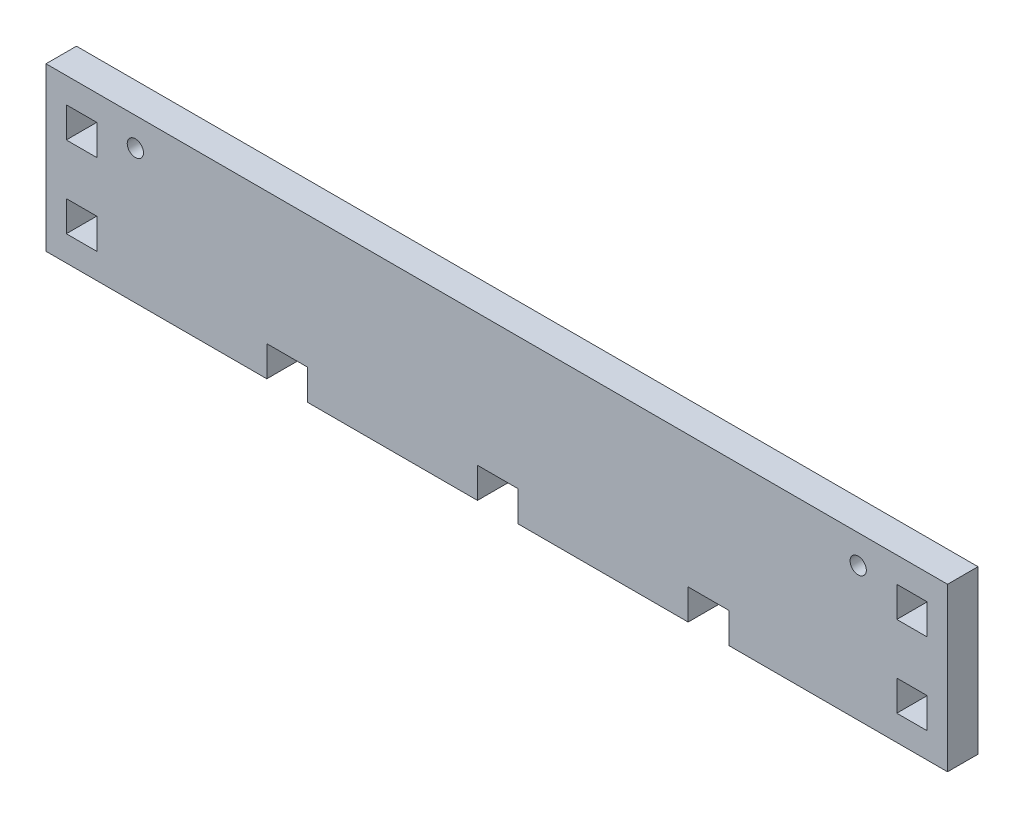
ISO-10303-21;
HEADER;
FILE_DESCRIPTION(('STEP AP214'),'2;1');
FILE_NAME('part.step','',(''),(''),'','','');
FILE_SCHEMA(('AUTOMOTIVE_DESIGN { 1 0 10303 214 1 1 1 1 }'));
ENDSEC;
DATA;
#1=APPLICATION_CONTEXT('core data for automotive mechanical design processes');
#2=APPLICATION_PROTOCOL_DEFINITION('international standard','automotive_design',2000,#1);
#3=PRODUCT_CONTEXT('',#1,'mechanical');
#4=PRODUCT('Part','Part','',(#3));
#5=PRODUCT_RELATED_PRODUCT_CATEGORY('part','',(#4));
#6=PRODUCT_DEFINITION_FORMATION('','',#4);
#7=PRODUCT_DEFINITION_CONTEXT('part definition',#1,'design');
#8=PRODUCT_DEFINITION('design','',#6,#7);
#9=PRODUCT_DEFINITION_SHAPE('','',#8);
#10=(LENGTH_UNIT() NAMED_UNIT(*) SI_UNIT(.MILLI.,.METRE.));
#11=(NAMED_UNIT(*) PLANE_ANGLE_UNIT() SI_UNIT($,.RADIAN.));
#12=(NAMED_UNIT(*) SI_UNIT($,.STERADIAN.) SOLID_ANGLE_UNIT());
#13=UNCERTAINTY_MEASURE_WITH_UNIT(LENGTH_MEASURE(1.E-05),#10,'distance_accuracy_value','');
#14=(GEOMETRIC_REPRESENTATION_CONTEXT(3) GLOBAL_UNCERTAINTY_ASSIGNED_CONTEXT((#13)) GLOBAL_UNIT_ASSIGNED_CONTEXT((#10,
#11,#12)) REPRESENTATION_CONTEXT('',''));
#15=CARTESIAN_POINT('',(0.,0.,0.));
#16=DIRECTION('',(0.,0.,1.));
#17=DIRECTION('',(1.,0.,0.));
#18=AXIS2_PLACEMENT_3D('',#15,#16,#17);
#19=CARTESIAN_POINT('',(0.,0.,15.));
#20=DIRECTION('',(0.,0.,1.));
#21=DIRECTION('',(1.,0.,0.));
#22=AXIS2_PLACEMENT_3D('',#19,#20,#21);
#23=PLANE('',#22);
#24=CARTESIAN_POINT('',(44.,66.,15.));
#25=DIRECTION('',(0.,0.,1.));
#26=DIRECTION('',(1.,0.,0.));
#27=AXIS2_PLACEMENT_3D('',#24,#25,#26);
#28=CIRCLE('',#27,4.00000000000001);
#29=CARTESIAN_POINT('',(48.,66.,15.));
#30=VERTEX_POINT('',#29);
#31=EDGE_CURVE('E284',#30,#30,#28,.T.);
#32=ORIENTED_EDGE('',*,*,#31,.F.);
#33=EDGE_LOOP('',(#32));
#34=FACE_BOUND('',#33,.T.);
#35=DIRECTION('',(1.,0.,0.));
#36=VECTOR('',#35,1.);
#37=CARTESIAN_POINT('',(0.,0.,15.));
#38=LINE('',#37,#36);
#39=CARTESIAN_POINT('',(0.,0.,15.));
#40=VERTEX_POINT('',#39);
#41=CARTESIAN_POINT('',(108.75,0.,15.));
#42=VERTEX_POINT('',#41);
#43=EDGE_CURVE('E429',#40,#42,#38,.T.);
#44=ORIENTED_EDGE('',*,*,#43,.T.);
#45=DIRECTION('',(0.,1.,0.));
#46=VECTOR('',#45,1.);
#47=CARTESIAN_POINT('',(108.75,0.,15.));
#48=LINE('',#47,#46);
#49=CARTESIAN_POINT('',(108.75,15.,15.));
#50=VERTEX_POINT('',#49);
#51=EDGE_CURVE('E433',#42,#50,#48,.T.);
#52=ORIENTED_EDGE('',*,*,#51,.T.);
#53=DIRECTION('',(1.,0.,0.));
#54=VECTOR('',#53,1.);
#55=CARTESIAN_POINT('',(108.75,15.,15.));
#56=LINE('',#55,#54);
#57=CARTESIAN_POINT('',(128.75,15.,15.));
#58=VERTEX_POINT('',#57);
#59=EDGE_CURVE('E437',#50,#58,#56,.T.);
#60=ORIENTED_EDGE('',*,*,#59,.T.);
#61=DIRECTION('',(0.,-1.,0.));
#62=VECTOR('',#61,1.);
#63=CARTESIAN_POINT('',(128.75,15.,15.));
#64=LINE('',#63,#62);
#65=CARTESIAN_POINT('',(128.75,0.,15.));
#66=VERTEX_POINT('',#65);
#67=EDGE_CURVE('E440',#58,#66,#64,.T.);
#68=ORIENTED_EDGE('',*,*,#67,.T.);
#69=DIRECTION('',(1.,0.,0.));
#70=VECTOR('',#69,1.);
#71=CARTESIAN_POINT('',(128.75,0.,15.));
#72=LINE('',#71,#70);
#73=CARTESIAN_POINT('',(212.5,0.,15.));
#74=VERTEX_POINT('',#73);
#75=EDGE_CURVE('E443',#66,#74,#72,.T.);
#76=ORIENTED_EDGE('',*,*,#75,.T.);
#77=DIRECTION('',(0.,1.,0.));
#78=VECTOR('',#77,1.);
#79=CARTESIAN_POINT('',(212.5,0.,15.));
#80=LINE('',#79,#78);
#81=CARTESIAN_POINT('',(212.5,15.,15.));
#82=VERTEX_POINT('',#81);
#83=EDGE_CURVE('E446',#74,#82,#80,.T.);
#84=ORIENTED_EDGE('',*,*,#83,.T.);
#85=DIRECTION('',(1.,0.,0.));
#86=VECTOR('',#85,1.);
#87=CARTESIAN_POINT('',(212.5,15.,15.));
#88=LINE('',#87,#86);
#89=CARTESIAN_POINT('',(232.5,15.,15.));
#90=VERTEX_POINT('',#89);
#91=EDGE_CURVE('E449',#82,#90,#88,.T.);
#92=ORIENTED_EDGE('',*,*,#91,.T.);
#93=DIRECTION('',(0.,-1.,0.));
#94=VECTOR('',#93,1.);
#95=CARTESIAN_POINT('',(232.5,15.,15.));
#96=LINE('',#95,#94);
#97=CARTESIAN_POINT('',(232.5,0.,15.));
#98=VERTEX_POINT('',#97);
#99=EDGE_CURVE('E452',#90,#98,#96,.T.);
#100=ORIENTED_EDGE('',*,*,#99,.T.);
#101=DIRECTION('',(1.,0.,0.));
#102=VECTOR('',#101,1.);
#103=CARTESIAN_POINT('',(232.5,0.,15.));
#104=LINE('',#103,#102);
#105=CARTESIAN_POINT('',(316.25,0.,15.));
#106=VERTEX_POINT('',#105);
#107=EDGE_CURVE('E455',#98,#106,#104,.T.);
#108=ORIENTED_EDGE('',*,*,#107,.T.);
#109=DIRECTION('',(0.,1.,0.));
#110=VECTOR('',#109,1.);
#111=CARTESIAN_POINT('',(316.25,0.,15.));
#112=LINE('',#111,#110);
#113=CARTESIAN_POINT('',(316.25,15.,15.));
#114=VERTEX_POINT('',#113);
#115=EDGE_CURVE('E458',#106,#114,#112,.T.);
#116=ORIENTED_EDGE('',*,*,#115,.T.);
#117=DIRECTION('',(1.,0.,0.));
#118=VECTOR('',#117,1.);
#119=CARTESIAN_POINT('',(316.25,15.,15.));
#120=LINE('',#119,#118);
#121=CARTESIAN_POINT('',(336.25,15.,15.));
#122=VERTEX_POINT('',#121);
#123=EDGE_CURVE('E461',#114,#122,#120,.T.);
#124=ORIENTED_EDGE('',*,*,#123,.T.);
#125=DIRECTION('',(0.,-1.,0.));
#126=VECTOR('',#125,1.);
#127=CARTESIAN_POINT('',(336.25,15.,15.));
#128=LINE('',#127,#126);
#129=CARTESIAN_POINT('',(336.25,0.,15.));
#130=VERTEX_POINT('',#129);
#131=EDGE_CURVE('E464',#122,#130,#128,.T.);
#132=ORIENTED_EDGE('',*,*,#131,.T.);
#133=DIRECTION('',(1.,0.,0.));
#134=VECTOR('',#133,1.);
#135=CARTESIAN_POINT('',(336.25,0.,15.));
#136=LINE('',#135,#134);
#137=CARTESIAN_POINT('',(444.,0.,15.));
#138=VERTEX_POINT('',#137);
#139=EDGE_CURVE('E467',#130,#138,#136,.T.);
#140=ORIENTED_EDGE('',*,*,#139,.T.);
#141=DIRECTION('',(0.,1.,0.));
#142=VECTOR('',#141,1.);
#143=CARTESIAN_POINT('',(444.,80.,15.));
#144=LINE('',#143,#142);
#145=CARTESIAN_POINT('',(444.,80.,15.));
#146=VERTEX_POINT('',#145);
#147=EDGE_CURVE('E470',#138,#146,#144,.T.);
#148=ORIENTED_EDGE('',*,*,#147,.T.);
#149=DIRECTION('',(-1.,0.,0.));
#150=VECTOR('',#149,1.);
#151=CARTESIAN_POINT('',(0.,80.,15.));
#152=LINE('',#151,#150);
#153=CARTESIAN_POINT('',(0.,80.,15.));
#154=VERTEX_POINT('',#153);
#155=EDGE_CURVE('E473',#146,#154,#152,.T.);
#156=ORIENTED_EDGE('',*,*,#155,.T.);
#157=DIRECTION('',(0.,-1.,0.));
#158=VECTOR('',#157,1.);
#159=CARTESIAN_POINT('',(0.,0.,15.));
#160=LINE('',#159,#158);
#161=EDGE_CURVE('E476',#154,#40,#160,.T.);
#162=ORIENTED_EDGE('',*,*,#161,.T.);
#163=EDGE_LOOP('',(#44,#52,#60,#68,#76,#84,#92,#100,#108,#116,#124,#132,#140,#148,#156,#162));
#164=FACE_BOUND('',#163,.T.);
#165=DIRECTION('',(1.,0.,0.));
#166=VECTOR('',#165,1.);
#167=CARTESIAN_POINT('',(10.,52.5,15.));
#168=LINE('',#167,#166);
#169=CARTESIAN_POINT('',(10.,52.5,15.));
#170=VERTEX_POINT('',#169);
#171=CARTESIAN_POINT('',(25.,52.5,15.));
#172=VERTEX_POINT('',#171);
#173=EDGE_CURVE('E389',#170,#172,#168,.T.);
#174=ORIENTED_EDGE('',*,*,#173,.F.);
#175=DIRECTION('',(0.,-1.,0.));
#176=VECTOR('',#175,1.);
#177=CARTESIAN_POINT('',(10.,67.5,15.));
#178=LINE('',#177,#176);
#179=CARTESIAN_POINT('',(10.,67.5,15.));
#180=VERTEX_POINT('',#179);
#181=EDGE_CURVE('E386',#180,#170,#178,.T.);
#182=ORIENTED_EDGE('',*,*,#181,.F.);
#183=DIRECTION('',(-1.,0.,0.));
#184=VECTOR('',#183,1.);
#185=CARTESIAN_POINT('',(10.,67.5,15.));
#186=LINE('',#185,#184);
#187=CARTESIAN_POINT('',(25.,67.5,15.));
#188=VERTEX_POINT('',#187);
#189=EDGE_CURVE('E397',#188,#180,#186,.T.);
#190=ORIENTED_EDGE('',*,*,#189,.F.);
#191=DIRECTION('',(0.,1.,0.));
#192=VECTOR('',#191,1.);
#193=CARTESIAN_POINT('',(25.,67.5,15.));
#194=LINE('',#193,#192);
#195=EDGE_CURVE('E393',#172,#188,#194,.T.);
#196=ORIENTED_EDGE('',*,*,#195,.F.);
#197=EDGE_LOOP('',(#174,#182,#190,#196));
#198=FACE_BOUND('',#197,.T.);
#199=DIRECTION('',(1.,0.,0.));
#200=VECTOR('',#199,1.);
#201=CARTESIAN_POINT('',(10.,12.5,15.));
#202=LINE('',#201,#200);
#203=CARTESIAN_POINT('',(10.,12.5,15.));
#204=VERTEX_POINT('',#203);
#205=CARTESIAN_POINT('',(25.,12.5,15.));
#206=VERTEX_POINT('',#205);
#207=EDGE_CURVE('E346',#204,#206,#202,.T.);
#208=ORIENTED_EDGE('',*,*,#207,.F.);
#209=DIRECTION('',(0.,-1.,0.));
#210=VECTOR('',#209,1.);
#211=CARTESIAN_POINT('',(10.,27.5,15.));
#212=LINE('',#211,#210);
#213=CARTESIAN_POINT('',(10.,27.5,15.));
#214=VERTEX_POINT('',#213);
#215=EDGE_CURVE('E343',#214,#204,#212,.T.);
#216=ORIENTED_EDGE('',*,*,#215,.F.);
#217=DIRECTION('',(-1.,0.,0.));
#218=VECTOR('',#217,1.);
#219=CARTESIAN_POINT('',(10.,27.5,15.));
#220=LINE('',#219,#218);
#221=CARTESIAN_POINT('',(25.,27.5,15.));
#222=VERTEX_POINT('',#221);
#223=EDGE_CURVE('E354',#222,#214,#220,.T.);
#224=ORIENTED_EDGE('',*,*,#223,.F.);
#225=DIRECTION('',(0.,1.,0.));
#226=VECTOR('',#225,1.);
#227=CARTESIAN_POINT('',(25.,27.5,15.));
#228=LINE('',#227,#226);
#229=EDGE_CURVE('E350',#206,#222,#228,.T.);
#230=ORIENTED_EDGE('',*,*,#229,.F.);
#231=EDGE_LOOP('',(#208,#216,#224,#230));
#232=FACE_BOUND('',#231,.T.);
#233=DIRECTION('',(0.,-1.,0.));
#234=VECTOR('',#233,1.);
#235=CARTESIAN_POINT('',(419.,27.5,15.));
#236=LINE('',#235,#234);
#237=CARTESIAN_POINT('',(419.,27.5,15.));
#238=VERTEX_POINT('',#237);
#239=CARTESIAN_POINT('',(419.,12.5,15.));
#240=VERTEX_POINT('',#239);
#241=EDGE_CURVE('E303',#238,#240,#236,.T.);
#242=ORIENTED_EDGE('',*,*,#241,.F.);
#243=DIRECTION('',(-1.,0.,0.));
#244=VECTOR('',#243,1.);
#245=CARTESIAN_POINT('',(434.,27.5,15.));
#246=LINE('',#245,#244);
#247=CARTESIAN_POINT('',(434.,27.5,15.));
#248=VERTEX_POINT('',#247);
#249=EDGE_CURVE('E300',#248,#238,#246,.T.);
#250=ORIENTED_EDGE('',*,*,#249,.F.);
#251=DIRECTION('',(0.,1.,0.));
#252=VECTOR('',#251,1.);
#253=CARTESIAN_POINT('',(434.,27.5,15.));
#254=LINE('',#253,#252);
#255=CARTESIAN_POINT('',(434.,12.5,15.));
#256=VERTEX_POINT('',#255);
#257=EDGE_CURVE('E311',#256,#248,#254,.T.);
#258=ORIENTED_EDGE('',*,*,#257,.F.);
#259=DIRECTION('',(1.,0.,0.));
#260=VECTOR('',#259,1.);
#261=CARTESIAN_POINT('',(434.,12.5,15.));
#262=LINE('',#261,#260);
#263=EDGE_CURVE('E307',#240,#256,#262,.T.);
#264=ORIENTED_EDGE('',*,*,#263,.F.);
#265=EDGE_LOOP('',(#242,#250,#258,#264));
#266=FACE_BOUND('',#265,.T.);
#267=DIRECTION('',(0.,-1.,0.));
#268=VECTOR('',#267,1.);
#269=CARTESIAN_POINT('',(419.,67.5,15.));
#270=LINE('',#269,#268);
#271=CARTESIAN_POINT('',(419.,67.5,15.));
#272=VERTEX_POINT('',#271);
#273=CARTESIAN_POINT('',(419.,52.5,15.));
#274=VERTEX_POINT('',#273);
#275=EDGE_CURVE('E258',#272,#274,#270,.T.);
#276=ORIENTED_EDGE('',*,*,#275,.F.);
#277=DIRECTION('',(-1.,0.,0.));
#278=VECTOR('',#277,1.);
#279=CARTESIAN_POINT('',(434.,67.5,15.));
#280=LINE('',#279,#278);
#281=CARTESIAN_POINT('',(434.,67.5,15.));
#282=VERTEX_POINT('',#281);
#283=EDGE_CURVE('E249',#282,#272,#280,.T.);
#284=ORIENTED_EDGE('',*,*,#283,.F.);
#285=DIRECTION('',(0.,1.,0.));
#286=VECTOR('',#285,1.);
#287=CARTESIAN_POINT('',(434.,67.5,15.));
#288=LINE('',#287,#286);
#289=CARTESIAN_POINT('',(434.,52.5,15.));
#290=VERTEX_POINT('',#289);
#291=EDGE_CURVE('E276',#290,#282,#288,.T.);
#292=ORIENTED_EDGE('',*,*,#291,.F.);
#293=DIRECTION('',(1.,0.,0.));
#294=VECTOR('',#293,1.);
#295=CARTESIAN_POINT('',(434.,52.5,15.));
#296=LINE('',#295,#294);
#297=EDGE_CURVE('E272',#274,#290,#296,.T.);
#298=ORIENTED_EDGE('',*,*,#297,.F.);
#299=EDGE_LOOP('',(#276,#284,#292,#298));
#300=FACE_BOUND('',#299,.T.);
#301=CARTESIAN_POINT('',(400.,66.,15.));
#302=DIRECTION('',(0.,0.,1.));
#303=DIRECTION('',(-1.,0.,0.));
#304=AXIS2_PLACEMENT_3D('',#301,#302,#303);
#305=CIRCLE('',#304,3.99999999999994);
#306=CARTESIAN_POINT('',(396.,66.,15.));
#307=VERTEX_POINT('',#306);
#308=EDGE_CURVE('E988',#307,#307,#305,.T.);
#309=ORIENTED_EDGE('',*,*,#308,.F.);
#310=EDGE_LOOP('',(#309));
#311=FACE_BOUND('',#310,.T.);
#312=ADVANCED_FACE('F39',(#34,#164,#198,#232,#266,#300,#311),#23,.T.);
#313=CARTESIAN_POINT('',(0.,0.,0.));
#314=DIRECTION('',(0.,0.,1.));
#315=DIRECTION('',(1.,0.,0.));
#316=AXIS2_PLACEMENT_3D('',#313,#314,#315);
#317=PLANE('',#316);
#318=DIRECTION('',(-1.,0.,0.));
#319=VECTOR('',#318,1.);
#320=CARTESIAN_POINT('',(434.,27.5,0.));
#321=LINE('',#320,#319);
#322=CARTESIAN_POINT('',(434.,27.5,0.));
#323=VERTEX_POINT('',#322);
#324=CARTESIAN_POINT('',(419.,27.5,0.));
#325=VERTEX_POINT('',#324);
#326=EDGE_CURVE('E267',#323,#325,#321,.T.);
#327=ORIENTED_EDGE('',*,*,#326,.T.);
#328=DIRECTION('',(0.,-1.,0.));
#329=VECTOR('',#328,1.);
#330=CARTESIAN_POINT('',(419.,27.5,0.));
#331=LINE('',#330,#329);
#332=CARTESIAN_POINT('',(419.,12.5,0.));
#333=VERTEX_POINT('',#332);
#334=EDGE_CURVE('E318',#325,#333,#331,.T.);
#335=ORIENTED_EDGE('',*,*,#334,.T.);
#336=DIRECTION('',(1.,0.,0.));
#337=VECTOR('',#336,1.);
#338=CARTESIAN_POINT('',(434.,12.5,0.));
#339=LINE('',#338,#337);
#340=CARTESIAN_POINT('',(434.,12.5,0.));
#341=VERTEX_POINT('',#340);
#342=EDGE_CURVE('E322',#333,#341,#339,.T.);
#343=ORIENTED_EDGE('',*,*,#342,.T.);
#344=DIRECTION('',(0.,1.,0.));
#345=VECTOR('',#344,1.);
#346=CARTESIAN_POINT('',(434.,27.5,0.));
#347=LINE('',#346,#345);
#348=EDGE_CURVE('E304',#341,#323,#347,.T.);
#349=ORIENTED_EDGE('',*,*,#348,.T.);
#350=EDGE_LOOP('',(#327,#335,#343,#349));
#351=FACE_BOUND('',#350,.T.);
#352=DIRECTION('',(0.,-1.,0.));
#353=VECTOR('',#352,1.);
#354=CARTESIAN_POINT('',(10.,67.5,0.));
#355=LINE('',#354,#353);
#356=CARTESIAN_POINT('',(10.,67.5,0.));
#357=VERTEX_POINT('',#356);
#358=CARTESIAN_POINT('',(10.,52.5,0.));
#359=VERTEX_POINT('',#358);
#360=EDGE_CURVE('E385',#357,#359,#355,.T.);
#361=ORIENTED_EDGE('',*,*,#360,.T.);
#362=DIRECTION('',(1.,0.,0.));
#363=VECTOR('',#362,1.);
#364=CARTESIAN_POINT('',(10.,52.5,0.));
#365=LINE('',#364,#363);
#366=CARTESIAN_POINT('',(25.,52.5,0.));
#367=VERTEX_POINT('',#366);
#368=EDGE_CURVE('E404',#359,#367,#365,.T.);
#369=ORIENTED_EDGE('',*,*,#368,.T.);
#370=DIRECTION('',(0.,1.,0.));
#371=VECTOR('',#370,1.);
#372=CARTESIAN_POINT('',(25.,67.5,0.));
#373=LINE('',#372,#371);
#374=CARTESIAN_POINT('',(25.,67.5,0.));
#375=VERTEX_POINT('',#374);
#376=EDGE_CURVE('E408',#367,#375,#373,.T.);
#377=ORIENTED_EDGE('',*,*,#376,.T.);
#378=DIRECTION('',(-1.,0.,0.));
#379=VECTOR('',#378,1.);
#380=CARTESIAN_POINT('',(10.,67.5,0.));
#381=LINE('',#380,#379);
#382=EDGE_CURVE('E390',#375,#357,#381,.T.);
#383=ORIENTED_EDGE('',*,*,#382,.T.);
#384=EDGE_LOOP('',(#361,#369,#377,#383));
#385=FACE_BOUND('',#384,.T.);
#386=DIRECTION('',(1.,0.,0.));
#387=VECTOR('',#386,1.);
#388=CARTESIAN_POINT('',(0.,0.,0.));
#389=LINE('',#388,#387);
#390=CARTESIAN_POINT('',(0.,0.,0.));
#391=VERTEX_POINT('',#390);
#392=CARTESIAN_POINT('',(108.75,0.,0.));
#393=VERTEX_POINT('',#392);
#394=EDGE_CURVE('E428',#391,#393,#389,.T.);
#395=ORIENTED_EDGE('',*,*,#394,.F.);
#396=DIRECTION('',(0.,-1.,0.));
#397=VECTOR('',#396,1.);
#398=CARTESIAN_POINT('',(0.,0.,0.));
#399=LINE('',#398,#397);
#400=CARTESIAN_POINT('',(0.,80.,0.));
#401=VERTEX_POINT('',#400);
#402=EDGE_CURVE('E434',#401,#391,#399,.T.);
#403=ORIENTED_EDGE('',*,*,#402,.F.);
#404=DIRECTION('',(-1.,0.,0.));
#405=VECTOR('',#404,1.);
#406=CARTESIAN_POINT('',(0.,80.,0.));
#407=LINE('',#406,#405);
#408=CARTESIAN_POINT('',(444.,80.,0.));
#409=VERTEX_POINT('',#408);
#410=EDGE_CURVE('E522',#409,#401,#407,.T.);
#411=ORIENTED_EDGE('',*,*,#410,.F.);
#412=DIRECTION('',(0.,1.,0.));
#413=VECTOR('',#412,1.);
#414=CARTESIAN_POINT('',(444.,80.,0.));
#415=LINE('',#414,#413);
#416=CARTESIAN_POINT('',(444.,0.,0.));
#417=VERTEX_POINT('',#416);
#418=EDGE_CURVE('E519',#417,#409,#415,.T.);
#419=ORIENTED_EDGE('',*,*,#418,.F.);
#420=DIRECTION('',(1.,0.,0.));
#421=VECTOR('',#420,1.);
#422=CARTESIAN_POINT('',(336.25,0.,0.));
#423=LINE('',#422,#421);
#424=CARTESIAN_POINT('',(336.25,0.,0.));
#425=VERTEX_POINT('',#424);
#426=EDGE_CURVE('E516',#425,#417,#423,.T.);
#427=ORIENTED_EDGE('',*,*,#426,.F.);
#428=DIRECTION('',(0.,-1.,0.));
#429=VECTOR('',#428,1.);
#430=CARTESIAN_POINT('',(336.25,15.,0.));
#431=LINE('',#430,#429);
#432=CARTESIAN_POINT('',(336.25,15.,0.));
#433=VERTEX_POINT('',#432);
#434=EDGE_CURVE('E513',#433,#425,#431,.T.);
#435=ORIENTED_EDGE('',*,*,#434,.F.);
#436=DIRECTION('',(1.,0.,0.));
#437=VECTOR('',#436,1.);
#438=CARTESIAN_POINT('',(316.25,15.,0.));
#439=LINE('',#438,#437);
#440=CARTESIAN_POINT('',(316.25,15.,0.));
#441=VERTEX_POINT('',#440);
#442=EDGE_CURVE('E510',#441,#433,#439,.T.);
#443=ORIENTED_EDGE('',*,*,#442,.F.);
#444=DIRECTION('',(0.,1.,0.));
#445=VECTOR('',#444,1.);
#446=CARTESIAN_POINT('',(316.25,0.,0.));
#447=LINE('',#446,#445);
#448=CARTESIAN_POINT('',(316.25,0.,0.));
#449=VERTEX_POINT('',#448);
#450=EDGE_CURVE('E507',#449,#441,#447,.T.);
#451=ORIENTED_EDGE('',*,*,#450,.F.);
#452=DIRECTION('',(1.,0.,0.));
#453=VECTOR('',#452,1.);
#454=CARTESIAN_POINT('',(232.5,0.,0.));
#455=LINE('',#454,#453);
#456=CARTESIAN_POINT('',(232.5,0.,0.));
#457=VERTEX_POINT('',#456);
#458=EDGE_CURVE('E504',#457,#449,#455,.T.);
#459=ORIENTED_EDGE('',*,*,#458,.F.);
#460=DIRECTION('',(0.,-1.,0.));
#461=VECTOR('',#460,1.);
#462=CARTESIAN_POINT('',(232.5,15.,0.));
#463=LINE('',#462,#461);
#464=CARTESIAN_POINT('',(232.5,15.,0.));
#465=VERTEX_POINT('',#464);
#466=EDGE_CURVE('E501',#465,#457,#463,.T.);
#467=ORIENTED_EDGE('',*,*,#466,.F.);
#468=DIRECTION('',(1.,0.,0.));
#469=VECTOR('',#468,1.);
#470=CARTESIAN_POINT('',(212.5,15.,0.));
#471=LINE('',#470,#469);
#472=CARTESIAN_POINT('',(212.5,15.,0.));
#473=VERTEX_POINT('',#472);
#474=EDGE_CURVE('E498',#473,#465,#471,.T.);
#475=ORIENTED_EDGE('',*,*,#474,.F.);
#476=DIRECTION('',(0.,1.,0.));
#477=VECTOR('',#476,1.);
#478=CARTESIAN_POINT('',(212.5,0.,0.));
#479=LINE('',#478,#477);
#480=CARTESIAN_POINT('',(212.5,0.,0.));
#481=VERTEX_POINT('',#480);
#482=EDGE_CURVE('E495',#481,#473,#479,.T.);
#483=ORIENTED_EDGE('',*,*,#482,.F.);
#484=DIRECTION('',(1.,0.,0.));
#485=VECTOR('',#484,1.);
#486=CARTESIAN_POINT('',(128.75,0.,0.));
#487=LINE('',#486,#485);
#488=CARTESIAN_POINT('',(128.75,0.,0.));
#489=VERTEX_POINT('',#488);
#490=EDGE_CURVE('E492',#489,#481,#487,.T.);
#491=ORIENTED_EDGE('',*,*,#490,.F.);
#492=DIRECTION('',(0.,-1.,0.));
#493=VECTOR('',#492,1.);
#494=CARTESIAN_POINT('',(128.75,15.,0.));
#495=LINE('',#494,#493);
#496=CARTESIAN_POINT('',(128.75,15.,0.));
#497=VERTEX_POINT('',#496);
#498=EDGE_CURVE('E489',#497,#489,#495,.T.);
#499=ORIENTED_EDGE('',*,*,#498,.F.);
#500=DIRECTION('',(1.,0.,0.));
#501=VECTOR('',#500,1.);
#502=CARTESIAN_POINT('',(108.75,15.,0.));
#503=LINE('',#502,#501);
#504=CARTESIAN_POINT('',(108.75,15.,0.));
#505=VERTEX_POINT('',#504);
#506=EDGE_CURVE('E486',#505,#497,#503,.T.);
#507=ORIENTED_EDGE('',*,*,#506,.F.);
#508=DIRECTION('',(0.,1.,0.));
#509=VECTOR('',#508,1.);
#510=CARTESIAN_POINT('',(108.75,0.,0.));
#511=LINE('',#510,#509);
#512=EDGE_CURVE('E483',#393,#505,#511,.T.);
#513=ORIENTED_EDGE('',*,*,#512,.F.);
#514=EDGE_LOOP('',(#395,#403,#411,#419,#427,#435,#443,#451,#459,#467,#475,#483,#491,#499,#507,#513));
#515=FACE_BOUND('',#514,.T.);
#516=DIRECTION('',(0.,-1.,0.));
#517=VECTOR('',#516,1.);
#518=CARTESIAN_POINT('',(10.,27.5,0.));
#519=LINE('',#518,#517);
#520=CARTESIAN_POINT('',(10.,27.5,0.));
#521=VERTEX_POINT('',#520);
#522=CARTESIAN_POINT('',(10.,12.5,0.));
#523=VERTEX_POINT('',#522);
#524=EDGE_CURVE('E342',#521,#523,#519,.T.);
#525=ORIENTED_EDGE('',*,*,#524,.T.);
#526=DIRECTION('',(1.,0.,0.));
#527=VECTOR('',#526,1.);
#528=CARTESIAN_POINT('',(10.,12.5,0.));
#529=LINE('',#528,#527);
#530=CARTESIAN_POINT('',(25.,12.5,0.));
#531=VERTEX_POINT('',#530);
#532=EDGE_CURVE('E361',#523,#531,#529,.T.);
#533=ORIENTED_EDGE('',*,*,#532,.T.);
#534=DIRECTION('',(0.,1.,0.));
#535=VECTOR('',#534,1.);
#536=CARTESIAN_POINT('',(25.,27.5,0.));
#537=LINE('',#536,#535);
#538=CARTESIAN_POINT('',(25.,27.5,0.));
#539=VERTEX_POINT('',#538);
#540=EDGE_CURVE('E365',#531,#539,#537,.T.);
#541=ORIENTED_EDGE('',*,*,#540,.T.);
#542=DIRECTION('',(-1.,0.,0.));
#543=VECTOR('',#542,1.);
#544=CARTESIAN_POINT('',(10.,27.5,0.));
#545=LINE('',#544,#543);
#546=EDGE_CURVE('E347',#539,#521,#545,.T.);
#547=ORIENTED_EDGE('',*,*,#546,.T.);
#548=EDGE_LOOP('',(#525,#533,#541,#547));
#549=FACE_BOUND('',#548,.T.);
#550=DIRECTION('',(-1.,0.,0.));
#551=VECTOR('',#550,1.);
#552=CARTESIAN_POINT('',(434.,67.5,0.));
#553=LINE('',#552,#551);
#554=CARTESIAN_POINT('',(434.,67.5,0.));
#555=VERTEX_POINT('',#554);
#556=CARTESIAN_POINT('',(419.,67.5,0.));
#557=VERTEX_POINT('',#556);
#558=EDGE_CURVE('E63',#555,#557,#553,.T.);
#559=ORIENTED_EDGE('',*,*,#558,.T.);
#560=DIRECTION('',(0.,-1.,0.));
#561=VECTOR('',#560,1.);
#562=CARTESIAN_POINT('',(419.,67.5,0.));
#563=LINE('',#562,#561);
#564=CARTESIAN_POINT('',(419.,52.5,0.));
#565=VERTEX_POINT('',#564);
#566=EDGE_CURVE('E265',#557,#565,#563,.T.);
#567=ORIENTED_EDGE('',*,*,#566,.T.);
#568=DIRECTION('',(1.,0.,0.));
#569=VECTOR('',#568,1.);
#570=CARTESIAN_POINT('',(434.,52.5,0.));
#571=LINE('',#570,#569);
#572=CARTESIAN_POINT('',(434.,52.5,0.));
#573=VERTEX_POINT('',#572);
#574=EDGE_CURVE('E287',#565,#573,#571,.T.);
#575=ORIENTED_EDGE('',*,*,#574,.T.);
#576=DIRECTION('',(0.,1.,0.));
#577=VECTOR('',#576,1.);
#578=CARTESIAN_POINT('',(434.,67.5,0.));
#579=LINE('',#578,#577);
#580=EDGE_CURVE('E259',#573,#555,#579,.T.);
#581=ORIENTED_EDGE('',*,*,#580,.T.);
#582=EDGE_LOOP('',(#559,#567,#575,#581));
#583=FACE_BOUND('',#582,.T.);
#584=CARTESIAN_POINT('',(44.,66.,0.));
#585=DIRECTION('',(0.,0.,1.));
#586=DIRECTION('',(1.,0.,0.));
#587=AXIS2_PLACEMENT_3D('',#584,#585,#586);
#588=CIRCLE('',#587,4.00000000000001);
#589=CARTESIAN_POINT('',(48.,66.,0.));
#590=VERTEX_POINT('',#589);
#591=EDGE_CURVE('E996',#590,#590,#588,.T.);
#592=ORIENTED_EDGE('',*,*,#591,.T.);
#593=EDGE_LOOP('',(#592));
#594=FACE_BOUND('',#593,.T.);
#595=CARTESIAN_POINT('',(400.,66.,0.));
#596=DIRECTION('',(0.,0.,1.));
#597=DIRECTION('',(-1.,0.,0.));
#598=AXIS2_PLACEMENT_3D('',#595,#596,#597);
#599=CIRCLE('',#598,3.99999999999994);
#600=CARTESIAN_POINT('',(396.,66.,0.));
#601=VERTEX_POINT('',#600);
#602=EDGE_CURVE('E991',#601,#601,#599,.T.);
#603=ORIENTED_EDGE('',*,*,#602,.T.);
#604=EDGE_LOOP('',(#603));
#605=FACE_BOUND('',#604,.T.);
#606=ADVANCED_FACE('F593',(#351,#385,#515,#549,#583,#594,#605),#317,.F.);
#607=CARTESIAN_POINT('',(0.,0.,15.));
#608=DIRECTION('',(0.,1.,0.));
#609=DIRECTION('',(0.,0.,1.));
#610=AXIS2_PLACEMENT_3D('',#607,#608,#609);
#611=PLANE('',#610);
#612=ORIENTED_EDGE('',*,*,#394,.T.);
#613=DIRECTION('',(0.,0.,-1.));
#614=VECTOR('',#613,1.);
#615=CARTESIAN_POINT('',(108.75,0.,15.));
#616=LINE('',#615,#614);
#617=EDGE_CURVE('E11',#42,#393,#616,.T.);
#618=ORIENTED_EDGE('',*,*,#617,.F.);
#619=ORIENTED_EDGE('',*,*,#43,.F.);
#620=DIRECTION('',(0.,0.,-1.));
#621=VECTOR('',#620,1.);
#622=CARTESIAN_POINT('',(0.,0.,15.));
#623=LINE('',#622,#621);
#624=EDGE_CURVE('E479',#40,#391,#623,.T.);
#625=ORIENTED_EDGE('',*,*,#624,.T.);
#626=EDGE_LOOP('',(#612,#618,#619,#625));
#627=FACE_BOUND('',#626,.T.);
#628=ADVANCED_FACE('F41',(#627),#611,.F.);
#629=CARTESIAN_POINT('',(108.75,0.,15.));
#630=DIRECTION('',(-1.,0.,0.));
#631=DIRECTION('',(0.,0.,1.));
#632=AXIS2_PLACEMENT_3D('',#629,#630,#631);
#633=PLANE('',#632);
#634=ORIENTED_EDGE('',*,*,#512,.T.);
#635=DIRECTION('',(0.,0.,-1.));
#636=VECTOR('',#635,1.);
#637=CARTESIAN_POINT('',(108.75,15.,15.));
#638=LINE('',#637,#636);
#639=EDGE_CURVE('E48',#50,#505,#638,.T.);
#640=ORIENTED_EDGE('',*,*,#639,.F.);
#641=ORIENTED_EDGE('',*,*,#51,.F.);
#642=ORIENTED_EDGE('',*,*,#617,.T.);
#643=EDGE_LOOP('',(#634,#640,#641,#642));
#644=FACE_BOUND('',#643,.T.);
#645=ADVANCED_FACE('F611',(#644),#633,.F.);
#646=CARTESIAN_POINT('',(108.75,15.,15.));
#647=DIRECTION('',(0.,1.,0.));
#648=DIRECTION('',(0.,0.,1.));
#649=AXIS2_PLACEMENT_3D('',#646,#647,#648);
#650=PLANE('',#649);
#651=ORIENTED_EDGE('',*,*,#506,.T.);
#652=DIRECTION('',(0.,0.,-1.));
#653=VECTOR('',#652,1.);
#654=CARTESIAN_POINT('',(128.75,15.,15.));
#655=LINE('',#654,#653);
#656=EDGE_CURVE('E578',#58,#497,#655,.T.);
#657=ORIENTED_EDGE('',*,*,#656,.F.);
#658=ORIENTED_EDGE('',*,*,#59,.F.);
#659=ORIENTED_EDGE('',*,*,#639,.T.);
#660=EDGE_LOOP('',(#651,#657,#658,#659));
#661=FACE_BOUND('',#660,.T.);
#662=ADVANCED_FACE('F587',(#661),#650,.F.);
#663=CARTESIAN_POINT('',(128.75,15.,15.));
#664=DIRECTION('',(1.,0.,0.));
#665=DIRECTION('',(0.,0.,-1.));
#666=AXIS2_PLACEMENT_3D('',#663,#664,#665);
#667=PLANE('',#666);
#668=ORIENTED_EDGE('',*,*,#498,.T.);
#669=DIRECTION('',(0.,0.,-1.));
#670=VECTOR('',#669,1.);
#671=CARTESIAN_POINT('',(128.75,0.,15.));
#672=LINE('',#671,#670);
#673=EDGE_CURVE('E574',#66,#489,#672,.T.);
#674=ORIENTED_EDGE('',*,*,#673,.F.);
#675=ORIENTED_EDGE('',*,*,#67,.F.);
#676=ORIENTED_EDGE('',*,*,#656,.T.);
#677=EDGE_LOOP('',(#668,#674,#675,#676));
#678=FACE_BOUND('',#677,.T.);
#679=ADVANCED_FACE('F599',(#678),#667,.F.);
#680=CARTESIAN_POINT('',(128.75,0.,15.));
#681=DIRECTION('',(0.,1.,0.));
#682=DIRECTION('',(0.,0.,1.));
#683=AXIS2_PLACEMENT_3D('',#680,#681,#682);
#684=PLANE('',#683);
#685=ORIENTED_EDGE('',*,*,#490,.T.);
#686=DIRECTION('',(0.,0.,-1.));
#687=VECTOR('',#686,1.);
#688=CARTESIAN_POINT('',(212.5,0.,15.));
#689=LINE('',#688,#687);
#690=EDGE_CURVE('E570',#74,#481,#689,.T.);
#691=ORIENTED_EDGE('',*,*,#690,.F.);
#692=ORIENTED_EDGE('',*,*,#75,.F.);
#693=ORIENTED_EDGE('',*,*,#673,.T.);
#694=EDGE_LOOP('',(#685,#691,#692,#693));
#695=FACE_BOUND('',#694,.T.);
#696=ADVANCED_FACE('F603',(#695),#684,.F.);
#697=CARTESIAN_POINT('',(212.5,0.,15.));
#698=DIRECTION('',(-1.,0.,0.));
#699=DIRECTION('',(0.,0.,1.));
#700=AXIS2_PLACEMENT_3D('',#697,#698,#699);
#701=PLANE('',#700);
#702=ORIENTED_EDGE('',*,*,#482,.T.);
#703=DIRECTION('',(0.,0.,-1.));
#704=VECTOR('',#703,1.);
#705=CARTESIAN_POINT('',(212.5,15.,15.));
#706=LINE('',#705,#704);
#707=EDGE_CURVE('E566',#82,#473,#706,.T.);
#708=ORIENTED_EDGE('',*,*,#707,.F.);
#709=ORIENTED_EDGE('',*,*,#83,.F.);
#710=ORIENTED_EDGE('',*,*,#690,.T.);
#711=EDGE_LOOP('',(#702,#708,#709,#710));
#712=FACE_BOUND('',#711,.T.);
#713=ADVANCED_FACE('F664',(#712),#701,.F.);
#714=CARTESIAN_POINT('',(212.5,15.,15.));
#715=DIRECTION('',(0.,1.,0.));
#716=DIRECTION('',(0.,0.,1.));
#717=AXIS2_PLACEMENT_3D('',#714,#715,#716);
#718=PLANE('',#717);
#719=ORIENTED_EDGE('',*,*,#474,.T.);
#720=DIRECTION('',(0.,0.,-1.));
#721=VECTOR('',#720,1.);
#722=CARTESIAN_POINT('',(232.5,15.,15.));
#723=LINE('',#722,#721);
#724=EDGE_CURVE('E562',#90,#465,#723,.T.);
#725=ORIENTED_EDGE('',*,*,#724,.F.);
#726=ORIENTED_EDGE('',*,*,#91,.F.);
#727=ORIENTED_EDGE('',*,*,#707,.T.);
#728=EDGE_LOOP('',(#719,#725,#726,#727));
#729=FACE_BOUND('',#728,.T.);
#730=ADVANCED_FACE('F661',(#729),#718,.F.);
#731=CARTESIAN_POINT('',(232.5,15.,15.));
#732=DIRECTION('',(1.,0.,0.));
#733=DIRECTION('',(0.,0.,-1.));
#734=AXIS2_PLACEMENT_3D('',#731,#732,#733);
#735=PLANE('',#734);
#736=ORIENTED_EDGE('',*,*,#466,.T.);
#737=DIRECTION('',(0.,0.,-1.));
#738=VECTOR('',#737,1.);
#739=CARTESIAN_POINT('',(232.5,0.,15.));
#740=LINE('',#739,#738);
#741=EDGE_CURVE('E558',#98,#457,#740,.T.);
#742=ORIENTED_EDGE('',*,*,#741,.F.);
#743=ORIENTED_EDGE('',*,*,#99,.F.);
#744=ORIENTED_EDGE('',*,*,#724,.T.);
#745=EDGE_LOOP('',(#736,#742,#743,#744));
#746=FACE_BOUND('',#745,.T.);
#747=ADVANCED_FACE('F657',(#746),#735,.F.);
#748=CARTESIAN_POINT('',(232.5,0.,15.));
#749=DIRECTION('',(0.,1.,0.));
#750=DIRECTION('',(0.,0.,1.));
#751=AXIS2_PLACEMENT_3D('',#748,#749,#750);
#752=PLANE('',#751);
#753=ORIENTED_EDGE('',*,*,#458,.T.);
#754=DIRECTION('',(0.,0.,-1.));
#755=VECTOR('',#754,1.);
#756=CARTESIAN_POINT('',(316.25,0.,15.));
#757=LINE('',#756,#755);
#758=EDGE_CURVE('E554',#106,#449,#757,.T.);
#759=ORIENTED_EDGE('',*,*,#758,.F.);
#760=ORIENTED_EDGE('',*,*,#107,.F.);
#761=ORIENTED_EDGE('',*,*,#741,.T.);
#762=EDGE_LOOP('',(#753,#759,#760,#761));
#763=FACE_BOUND('',#762,.T.);
#764=ADVANCED_FACE('F653',(#763),#752,.F.);
#765=CARTESIAN_POINT('',(316.25,0.,15.));
#766=DIRECTION('',(-1.,0.,0.));
#767=DIRECTION('',(0.,0.,1.));
#768=AXIS2_PLACEMENT_3D('',#765,#766,#767);
#769=PLANE('',#768);
#770=ORIENTED_EDGE('',*,*,#450,.T.);
#771=DIRECTION('',(0.,0.,-1.));
#772=VECTOR('',#771,1.);
#773=CARTESIAN_POINT('',(316.25,15.,15.));
#774=LINE('',#773,#772);
#775=EDGE_CURVE('E550',#114,#441,#774,.T.);
#776=ORIENTED_EDGE('',*,*,#775,.F.);
#777=ORIENTED_EDGE('',*,*,#115,.F.);
#778=ORIENTED_EDGE('',*,*,#758,.T.);
#779=EDGE_LOOP('',(#770,#776,#777,#778));
#780=FACE_BOUND('',#779,.T.);
#781=ADVANCED_FACE('F648',(#780),#769,.F.);
#782=CARTESIAN_POINT('',(316.25,15.,15.));
#783=DIRECTION('',(0.,1.,0.));
#784=DIRECTION('',(0.,0.,1.));
#785=AXIS2_PLACEMENT_3D('',#782,#783,#784);
#786=PLANE('',#785);
#787=ORIENTED_EDGE('',*,*,#442,.T.);
#788=DIRECTION('',(0.,0.,-1.));
#789=VECTOR('',#788,1.);
#790=CARTESIAN_POINT('',(336.25,15.,15.));
#791=LINE('',#790,#789);
#792=EDGE_CURVE('E546',#122,#433,#791,.T.);
#793=ORIENTED_EDGE('',*,*,#792,.F.);
#794=ORIENTED_EDGE('',*,*,#123,.F.);
#795=ORIENTED_EDGE('',*,*,#775,.T.);
#796=EDGE_LOOP('',(#787,#793,#794,#795));
#797=FACE_BOUND('',#796,.T.);
#798=ADVANCED_FACE('F642',(#797),#786,.F.);
#799=CARTESIAN_POINT('',(336.25,15.,15.));
#800=DIRECTION('',(1.,0.,0.));
#801=DIRECTION('',(0.,0.,-1.));
#802=AXIS2_PLACEMENT_3D('',#799,#800,#801);
#803=PLANE('',#802);
#804=ORIENTED_EDGE('',*,*,#434,.T.);
#805=DIRECTION('',(0.,0.,-1.));
#806=VECTOR('',#805,1.);
#807=CARTESIAN_POINT('',(336.25,0.,15.));
#808=LINE('',#807,#806);
#809=EDGE_CURVE('E542',#130,#425,#808,.T.);
#810=ORIENTED_EDGE('',*,*,#809,.F.);
#811=ORIENTED_EDGE('',*,*,#131,.F.);
#812=ORIENTED_EDGE('',*,*,#792,.T.);
#813=EDGE_LOOP('',(#804,#810,#811,#812));
#814=FACE_BOUND('',#813,.T.);
#815=ADVANCED_FACE('F638',(#814),#803,.F.);
#816=CARTESIAN_POINT('',(336.25,0.,15.));
#817=DIRECTION('',(0.,1.,0.));
#818=DIRECTION('',(0.,0.,1.));
#819=AXIS2_PLACEMENT_3D('',#816,#817,#818);
#820=PLANE('',#819);
#821=ORIENTED_EDGE('',*,*,#426,.T.);
#822=DIRECTION('',(0.,0.,-1.));
#823=VECTOR('',#822,1.);
#824=CARTESIAN_POINT('',(444.,0.,15.));
#825=LINE('',#824,#823);
#826=EDGE_CURVE('E538',#138,#417,#825,.T.);
#827=ORIENTED_EDGE('',*,*,#826,.F.);
#828=ORIENTED_EDGE('',*,*,#139,.F.);
#829=ORIENTED_EDGE('',*,*,#809,.T.);
#830=EDGE_LOOP('',(#821,#827,#828,#829));
#831=FACE_BOUND('',#830,.T.);
#832=ADVANCED_FACE('F633',(#831),#820,.F.);
#833=CARTESIAN_POINT('',(444.,80.,15.));
#834=DIRECTION('',(-1.,0.,0.));
#835=DIRECTION('',(0.,0.,1.));
#836=AXIS2_PLACEMENT_3D('',#833,#834,#835);
#837=PLANE('',#836);
#838=ORIENTED_EDGE('',*,*,#418,.T.);
#839=DIRECTION('',(0.,0.,-1.));
#840=VECTOR('',#839,1.);
#841=CARTESIAN_POINT('',(444.,80.,15.));
#842=LINE('',#841,#840);
#843=EDGE_CURVE('E534',#146,#409,#842,.T.);
#844=ORIENTED_EDGE('',*,*,#843,.F.);
#845=ORIENTED_EDGE('',*,*,#147,.F.);
#846=ORIENTED_EDGE('',*,*,#826,.T.);
#847=EDGE_LOOP('',(#838,#844,#845,#846));
#848=FACE_BOUND('',#847,.T.);
#849=ADVANCED_FACE('F627',(#848),#837,.F.);
#850=CARTESIAN_POINT('',(0.,80.,15.));
#851=DIRECTION('',(0.,-1.,0.));
#852=DIRECTION('',(0.,0.,-1.));
#853=AXIS2_PLACEMENT_3D('',#850,#851,#852);
#854=PLANE('',#853);
#855=ORIENTED_EDGE('',*,*,#410,.T.);
#856=DIRECTION('',(0.,0.,-1.));
#857=VECTOR('',#856,1.);
#858=CARTESIAN_POINT('',(0.,80.,15.));
#859=LINE('',#858,#857);
#860=EDGE_CURVE('E530',#154,#401,#859,.T.);
#861=ORIENTED_EDGE('',*,*,#860,.F.);
#862=ORIENTED_EDGE('',*,*,#155,.F.);
#863=ORIENTED_EDGE('',*,*,#843,.T.);
#864=EDGE_LOOP('',(#855,#861,#862,#863));
#865=FACE_BOUND('',#864,.T.);
#866=ADVANCED_FACE('F623',(#865),#854,.F.);
#867=CARTESIAN_POINT('',(0.,0.,15.));
#868=DIRECTION('',(1.,0.,0.));
#869=DIRECTION('',(0.,0.,-1.));
#870=AXIS2_PLACEMENT_3D('',#867,#868,#869);
#871=PLANE('',#870);
#872=ORIENTED_EDGE('',*,*,#402,.T.);
#873=ORIENTED_EDGE('',*,*,#624,.F.);
#874=ORIENTED_EDGE('',*,*,#161,.F.);
#875=ORIENTED_EDGE('',*,*,#860,.T.);
#876=EDGE_LOOP('',(#872,#873,#874,#875));
#877=FACE_BOUND('',#876,.T.);
#878=ADVANCED_FACE('F618',(#877),#871,.F.);
#879=CARTESIAN_POINT('',(10.,67.5,15.));
#880=DIRECTION('',(1.,0.,0.));
#881=DIRECTION('',(0.,1.,0.));
#882=AXIS2_PLACEMENT_3D('',#879,#880,#881);
#883=PLANE('',#882);
#884=ORIENTED_EDGE('',*,*,#360,.F.);
#885=DIRECTION('',(0.,0.,-1.));
#886=VECTOR('',#885,1.);
#887=CARTESIAN_POINT('',(10.,67.5,15.));
#888=LINE('',#887,#886);
#889=EDGE_CURVE('E400',#180,#357,#888,.T.);
#890=ORIENTED_EDGE('',*,*,#889,.F.);
#891=ORIENTED_EDGE('',*,*,#181,.T.);
#892=DIRECTION('',(0.,0.,-1.));
#893=VECTOR('',#892,1.);
#894=CARTESIAN_POINT('',(10.,52.5,15.));
#895=LINE('',#894,#893);
#896=EDGE_CURVE('E424',#170,#359,#895,.T.);
#897=ORIENTED_EDGE('',*,*,#896,.T.);
#898=EDGE_LOOP('',(#884,#890,#891,#897));
#899=FACE_BOUND('',#898,.T.);
#900=ADVANCED_FACE('F683',(#899),#883,.T.);
#901=CARTESIAN_POINT('',(10.,52.5,15.));
#902=DIRECTION('',(0.,1.,0.));
#903=DIRECTION('',(0.,0.,1.));
#904=AXIS2_PLACEMENT_3D('',#901,#902,#903);
#905=PLANE('',#904);
#906=ORIENTED_EDGE('',*,*,#368,.F.);
#907=ORIENTED_EDGE('',*,*,#896,.F.);
#908=ORIENTED_EDGE('',*,*,#173,.T.);
#909=DIRECTION('',(0.,0.,-1.));
#910=VECTOR('',#909,1.);
#911=CARTESIAN_POINT('',(25.,52.5,15.));
#912=LINE('',#911,#910);
#913=EDGE_CURVE('E421',#172,#367,#912,.T.);
#914=ORIENTED_EDGE('',*,*,#913,.T.);
#915=EDGE_LOOP('',(#906,#907,#908,#914));
#916=FACE_BOUND('',#915,.T.);
#917=ADVANCED_FACE('F745',(#916),#905,.T.);
#918=CARTESIAN_POINT('',(25.,67.5,15.));
#919=DIRECTION('',(-1.,0.,0.));
#920=DIRECTION('',(0.,0.,1.));
#921=AXIS2_PLACEMENT_3D('',#918,#919,#920);
#922=PLANE('',#921);
#923=ORIENTED_EDGE('',*,*,#376,.F.);
#924=ORIENTED_EDGE('',*,*,#913,.F.);
#925=ORIENTED_EDGE('',*,*,#195,.T.);
#926=DIRECTION('',(0.,0.,-1.));
#927=VECTOR('',#926,1.);
#928=CARTESIAN_POINT('',(25.,67.5,15.));
#929=LINE('',#928,#927);
#930=EDGE_CURVE('E418',#188,#375,#929,.T.);
#931=ORIENTED_EDGE('',*,*,#930,.T.);
#932=EDGE_LOOP('',(#923,#924,#925,#931));
#933=FACE_BOUND('',#932,.T.);
#934=ADVANCED_FACE('F752',(#933),#922,.T.);
#935=CARTESIAN_POINT('',(10.,67.5,15.));
#936=DIRECTION('',(0.,-1.,0.));
#937=DIRECTION('',(0.,0.,-1.));
#938=AXIS2_PLACEMENT_3D('',#935,#936,#937);
#939=PLANE('',#938);
#940=ORIENTED_EDGE('',*,*,#382,.F.);
#941=ORIENTED_EDGE('',*,*,#930,.F.);
#942=ORIENTED_EDGE('',*,*,#189,.T.);
#943=ORIENTED_EDGE('',*,*,#889,.T.);
#944=EDGE_LOOP('',(#940,#941,#942,#943));
#945=FACE_BOUND('',#944,.T.);
#946=ADVANCED_FACE('F759',(#945),#939,.T.);
#947=CARTESIAN_POINT('',(10.,27.5,15.));
#948=DIRECTION('',(1.,0.,0.));
#949=DIRECTION('',(0.,1.,0.));
#950=AXIS2_PLACEMENT_3D('',#947,#948,#949);
#951=PLANE('',#950);
#952=ORIENTED_EDGE('',*,*,#524,.F.);
#953=DIRECTION('',(0.,0.,-1.));
#954=VECTOR('',#953,1.);
#955=CARTESIAN_POINT('',(10.,27.5,15.));
#956=LINE('',#955,#954);
#957=EDGE_CURVE('E357',#214,#521,#956,.T.);
#958=ORIENTED_EDGE('',*,*,#957,.F.);
#959=ORIENTED_EDGE('',*,*,#215,.T.);
#960=DIRECTION('',(0.,0.,-1.));
#961=VECTOR('',#960,1.);
#962=CARTESIAN_POINT('',(10.,12.5,15.));
#963=LINE('',#962,#961);
#964=EDGE_CURVE('E381',#204,#523,#963,.T.);
#965=ORIENTED_EDGE('',*,*,#964,.T.);
#966=EDGE_LOOP('',(#952,#958,#959,#965));
#967=FACE_BOUND('',#966,.T.);
#968=ADVANCED_FACE('F767',(#967),#951,.T.);
#969=CARTESIAN_POINT('',(10.,12.5,15.));
#970=DIRECTION('',(0.,1.,0.));
#971=DIRECTION('',(0.,0.,1.));
#972=AXIS2_PLACEMENT_3D('',#969,#970,#971);
#973=PLANE('',#972);
#974=ORIENTED_EDGE('',*,*,#532,.F.);
#975=ORIENTED_EDGE('',*,*,#964,.F.);
#976=ORIENTED_EDGE('',*,*,#207,.T.);
#977=DIRECTION('',(0.,0.,-1.));
#978=VECTOR('',#977,1.);
#979=CARTESIAN_POINT('',(25.,12.5,15.));
#980=LINE('',#979,#978);
#981=EDGE_CURVE('E378',#206,#531,#980,.T.);
#982=ORIENTED_EDGE('',*,*,#981,.T.);
#983=EDGE_LOOP('',(#974,#975,#976,#982));
#984=FACE_BOUND('',#983,.T.);
#985=ADVANCED_FACE('F775',(#984),#973,.T.);
#986=CARTESIAN_POINT('',(25.,27.5,15.));
#987=DIRECTION('',(-1.,0.,0.));
#988=DIRECTION('',(0.,-1.,0.));
#989=AXIS2_PLACEMENT_3D('',#986,#987,#988);
#990=PLANE('',#989);
#991=ORIENTED_EDGE('',*,*,#540,.F.);
#992=ORIENTED_EDGE('',*,*,#981,.F.);
#993=ORIENTED_EDGE('',*,*,#229,.T.);
#994=DIRECTION('',(0.,0.,-1.));
#995=VECTOR('',#994,1.);
#996=CARTESIAN_POINT('',(25.,27.5,15.));
#997=LINE('',#996,#995);
#998=EDGE_CURVE('E375',#222,#539,#997,.T.);
#999=ORIENTED_EDGE('',*,*,#998,.T.);
#1000=EDGE_LOOP('',(#991,#992,#993,#999));
#1001=FACE_BOUND('',#1000,.T.);
#1002=ADVANCED_FACE('F783',(#1001),#990,.T.);
#1003=CARTESIAN_POINT('',(10.,27.5,15.));
#1004=DIRECTION('',(0.,-1.,0.));
#1005=DIRECTION('',(0.,0.,-1.));
#1006=AXIS2_PLACEMENT_3D('',#1003,#1004,#1005);
#1007=PLANE('',#1006);
#1008=ORIENTED_EDGE('',*,*,#546,.F.);
#1009=ORIENTED_EDGE('',*,*,#998,.F.);
#1010=ORIENTED_EDGE('',*,*,#223,.T.);
#1011=ORIENTED_EDGE('',*,*,#957,.T.);
#1012=EDGE_LOOP('',(#1008,#1009,#1010,#1011));
#1013=FACE_BOUND('',#1012,.T.);
#1014=ADVANCED_FACE('F791',(#1013),#1007,.T.);
#1015=CARTESIAN_POINT('',(434.,27.5,15.));
#1016=DIRECTION('',(0.,-1.,0.));
#1017=DIRECTION('',(0.,0.,-1.));
#1018=AXIS2_PLACEMENT_3D('',#1015,#1016,#1017);
#1019=PLANE('',#1018);
#1020=ORIENTED_EDGE('',*,*,#326,.F.);
#1021=DIRECTION('',(0.,0.,-1.));
#1022=VECTOR('',#1021,1.);
#1023=CARTESIAN_POINT('',(434.,27.5,15.));
#1024=LINE('',#1023,#1022);
#1025=EDGE_CURVE('E314',#248,#323,#1024,.T.);
#1026=ORIENTED_EDGE('',*,*,#1025,.F.);
#1027=ORIENTED_EDGE('',*,*,#249,.T.);
#1028=DIRECTION('',(0.,0.,-1.));
#1029=VECTOR('',#1028,1.);
#1030=CARTESIAN_POINT('',(419.,27.5,15.));
#1031=LINE('',#1030,#1029);
#1032=EDGE_CURVE('E338',#238,#325,#1031,.T.);
#1033=ORIENTED_EDGE('',*,*,#1032,.T.);
#1034=EDGE_LOOP('',(#1020,#1026,#1027,#1033));
#1035=FACE_BOUND('',#1034,.T.);
#1036=ADVANCED_FACE('F799',(#1035),#1019,.T.);
#1037=CARTESIAN_POINT('',(419.,27.5,15.));
#1038=DIRECTION('',(1.,0.,0.));
#1039=DIRECTION('',(0.,0.,-1.));
#1040=AXIS2_PLACEMENT_3D('',#1037,#1038,#1039);
#1041=PLANE('',#1040);
#1042=ORIENTED_EDGE('',*,*,#334,.F.);
#1043=ORIENTED_EDGE('',*,*,#1032,.F.);
#1044=ORIENTED_EDGE('',*,*,#241,.T.);
#1045=DIRECTION('',(0.,0.,-1.));
#1046=VECTOR('',#1045,1.);
#1047=CARTESIAN_POINT('',(419.,12.5,15.));
#1048=LINE('',#1047,#1046);
#1049=EDGE_CURVE('E335',#240,#333,#1048,.T.);
#1050=ORIENTED_EDGE('',*,*,#1049,.T.);
#1051=EDGE_LOOP('',(#1042,#1043,#1044,#1050));
#1052=FACE_BOUND('',#1051,.T.);
#1053=ADVANCED_FACE('F807',(#1052),#1041,.T.);
#1054=CARTESIAN_POINT('',(434.,12.5,15.));
#1055=DIRECTION('',(0.,1.,0.));
#1056=DIRECTION('',(0.,0.,1.));
#1057=AXIS2_PLACEMENT_3D('',#1054,#1055,#1056);
#1058=PLANE('',#1057);
#1059=ORIENTED_EDGE('',*,*,#342,.F.);
#1060=ORIENTED_EDGE('',*,*,#1049,.F.);
#1061=ORIENTED_EDGE('',*,*,#263,.T.);
#1062=DIRECTION('',(0.,0.,-1.));
#1063=VECTOR('',#1062,1.);
#1064=CARTESIAN_POINT('',(434.,12.5,15.));
#1065=LINE('',#1064,#1063);
#1066=EDGE_CURVE('E332',#256,#341,#1065,.T.);
#1067=ORIENTED_EDGE('',*,*,#1066,.T.);
#1068=EDGE_LOOP('',(#1059,#1060,#1061,#1067));
#1069=FACE_BOUND('',#1068,.T.);
#1070=ADVANCED_FACE('F815',(#1069),#1058,.T.);
#1071=CARTESIAN_POINT('',(434.,27.5,15.));
#1072=DIRECTION('',(-1.,0.,0.));
#1073=DIRECTION('',(0.,0.,1.));
#1074=AXIS2_PLACEMENT_3D('',#1071,#1072,#1073);
#1075=PLANE('',#1074);
#1076=ORIENTED_EDGE('',*,*,#348,.F.);
#1077=ORIENTED_EDGE('',*,*,#1066,.F.);
#1078=ORIENTED_EDGE('',*,*,#257,.T.);
#1079=ORIENTED_EDGE('',*,*,#1025,.T.);
#1080=EDGE_LOOP('',(#1076,#1077,#1078,#1079));
#1081=FACE_BOUND('',#1080,.T.);
#1082=ADVANCED_FACE('F823',(#1081),#1075,.T.);
#1083=CARTESIAN_POINT('',(434.,67.5,15.));
#1084=DIRECTION('',(0.,-1.,0.));
#1085=DIRECTION('',(0.,0.,-1.));
#1086=AXIS2_PLACEMENT_3D('',#1083,#1084,#1085);
#1087=PLANE('',#1086);
#1088=ORIENTED_EDGE('',*,*,#558,.F.);
#1089=DIRECTION('',(0.,0.,-1.));
#1090=VECTOR('',#1089,1.);
#1091=CARTESIAN_POINT('',(434.,67.5,15.));
#1092=LINE('',#1091,#1090);
#1093=EDGE_CURVE('E253',#282,#555,#1092,.T.);
#1094=ORIENTED_EDGE('',*,*,#1093,.F.);
#1095=ORIENTED_EDGE('',*,*,#283,.T.);
#1096=DIRECTION('',(0.,0.,-1.));
#1097=VECTOR('',#1096,1.);
#1098=CARTESIAN_POINT('',(419.,67.5,15.));
#1099=LINE('',#1098,#1097);
#1100=EDGE_CURVE('E252',#272,#557,#1099,.T.);
#1101=ORIENTED_EDGE('',*,*,#1100,.T.);
#1102=EDGE_LOOP('',(#1088,#1094,#1095,#1101));
#1103=FACE_BOUND('',#1102,.T.);
#1104=ADVANCED_FACE('F251',(#1103),#1087,.T.);
#1105=CARTESIAN_POINT('',(419.,67.5,15.));
#1106=DIRECTION('',(1.,0.,0.));
#1107=DIRECTION('',(0.,0.,-1.));
#1108=AXIS2_PLACEMENT_3D('',#1105,#1106,#1107);
#1109=PLANE('',#1108);
#1110=ORIENTED_EDGE('',*,*,#566,.F.);
#1111=ORIENTED_EDGE('',*,*,#1100,.F.);
#1112=ORIENTED_EDGE('',*,*,#275,.T.);
#1113=DIRECTION('',(0.,0.,-1.));
#1114=VECTOR('',#1113,1.);
#1115=CARTESIAN_POINT('',(419.,52.5,15.));
#1116=LINE('',#1115,#1114);
#1117=EDGE_CURVE('E268',#274,#565,#1116,.T.);
#1118=ORIENTED_EDGE('',*,*,#1117,.T.);
#1119=EDGE_LOOP('',(#1110,#1111,#1112,#1118));
#1120=FACE_BOUND('',#1119,.T.);
#1121=ADVANCED_FACE('F262',(#1120),#1109,.T.);
#1122=CARTESIAN_POINT('',(434.,52.5,15.));
#1123=DIRECTION('',(0.,1.,0.));
#1124=DIRECTION('',(0.,0.,1.));
#1125=AXIS2_PLACEMENT_3D('',#1122,#1123,#1124);
#1126=PLANE('',#1125);
#1127=ORIENTED_EDGE('',*,*,#574,.F.);
#1128=ORIENTED_EDGE('',*,*,#1117,.F.);
#1129=ORIENTED_EDGE('',*,*,#297,.T.);
#1130=DIRECTION('',(0.,0.,-1.));
#1131=VECTOR('',#1130,1.);
#1132=CARTESIAN_POINT('',(434.,52.5,15.));
#1133=LINE('',#1132,#1131);
#1134=EDGE_CURVE('E55',#290,#573,#1133,.T.);
#1135=ORIENTED_EDGE('',*,*,#1134,.T.);
#1136=EDGE_LOOP('',(#1127,#1128,#1129,#1135));
#1137=FACE_BOUND('',#1136,.T.);
#1138=ADVANCED_FACE('F844',(#1137),#1126,.T.);
#1139=CARTESIAN_POINT('',(434.,67.5,15.));
#1140=DIRECTION('',(-1.,0.,0.));
#1141=DIRECTION('',(0.,0.,1.));
#1142=AXIS2_PLACEMENT_3D('',#1139,#1140,#1141);
#1143=PLANE('',#1142);
#1144=ORIENTED_EDGE('',*,*,#580,.F.);
#1145=ORIENTED_EDGE('',*,*,#1134,.F.);
#1146=ORIENTED_EDGE('',*,*,#291,.T.);
#1147=ORIENTED_EDGE('',*,*,#1093,.T.);
#1148=EDGE_LOOP('',(#1144,#1145,#1146,#1147));
#1149=FACE_BOUND('',#1148,.T.);
#1150=ADVANCED_FACE('F851',(#1149),#1143,.T.);
#1151=CARTESIAN_POINT('',(44.,66.,15.));
#1152=DIRECTION('',(0.,0.,-1.));
#1153=DIRECTION('',(-1.,0.,0.));
#1154=AXIS2_PLACEMENT_3D('',#1151,#1152,#1153);
#1155=CYLINDRICAL_SURFACE('',#1154,4.00000000000001);
#1156=ORIENTED_EDGE('',*,*,#31,.T.);
#1157=EDGE_LOOP('',(#1156));
#1158=FACE_BOUND('',#1157,.T.);
#1159=ORIENTED_EDGE('',*,*,#591,.F.);
#1160=EDGE_LOOP('',(#1159));
#1161=FACE_BOUND('',#1160,.T.);
#1162=ADVANCED_FACE('F859',(#1158,#1161),#1155,.F.);
#1163=CARTESIAN_POINT('',(400.,66.,15.));
#1164=DIRECTION('',(0.,0.,-1.));
#1165=DIRECTION('',(-1.,0.,0.));
#1166=AXIS2_PLACEMENT_3D('',#1163,#1164,#1165);
#1167=CYLINDRICAL_SURFACE('',#1166,3.99999999999994);
#1168=ORIENTED_EDGE('',*,*,#308,.T.);
#1169=EDGE_LOOP('',(#1168));
#1170=FACE_BOUND('',#1169,.T.);
#1171=ORIENTED_EDGE('',*,*,#602,.F.);
#1172=EDGE_LOOP('',(#1171));
#1173=FACE_BOUND('',#1172,.T.);
#1174=ADVANCED_FACE('F866',(#1170,#1173),#1167,.F.);
#1175=CLOSED_SHELL('',(#312,#606,#628,#645,#662,#679,#696,#713,#730,#747,#764,#781,#798,#815,
#832,#849,#866,#878,#900,#917,#934,#946,#968,#985,#1002,#1014,#1036,#1053,#1070,#1082,#1104,
#1121,#1138,#1150,#1162,#1174));
#1176=MANIFOLD_SOLID_BREP('B2',#1175);
#1177=ADVANCED_BREP_SHAPE_REPRESENTATION('',(#18,#1176),#14);
#1178=SHAPE_DEFINITION_REPRESENTATION(#9,#1177);
ENDSEC;
END-ISO-10303-21;
